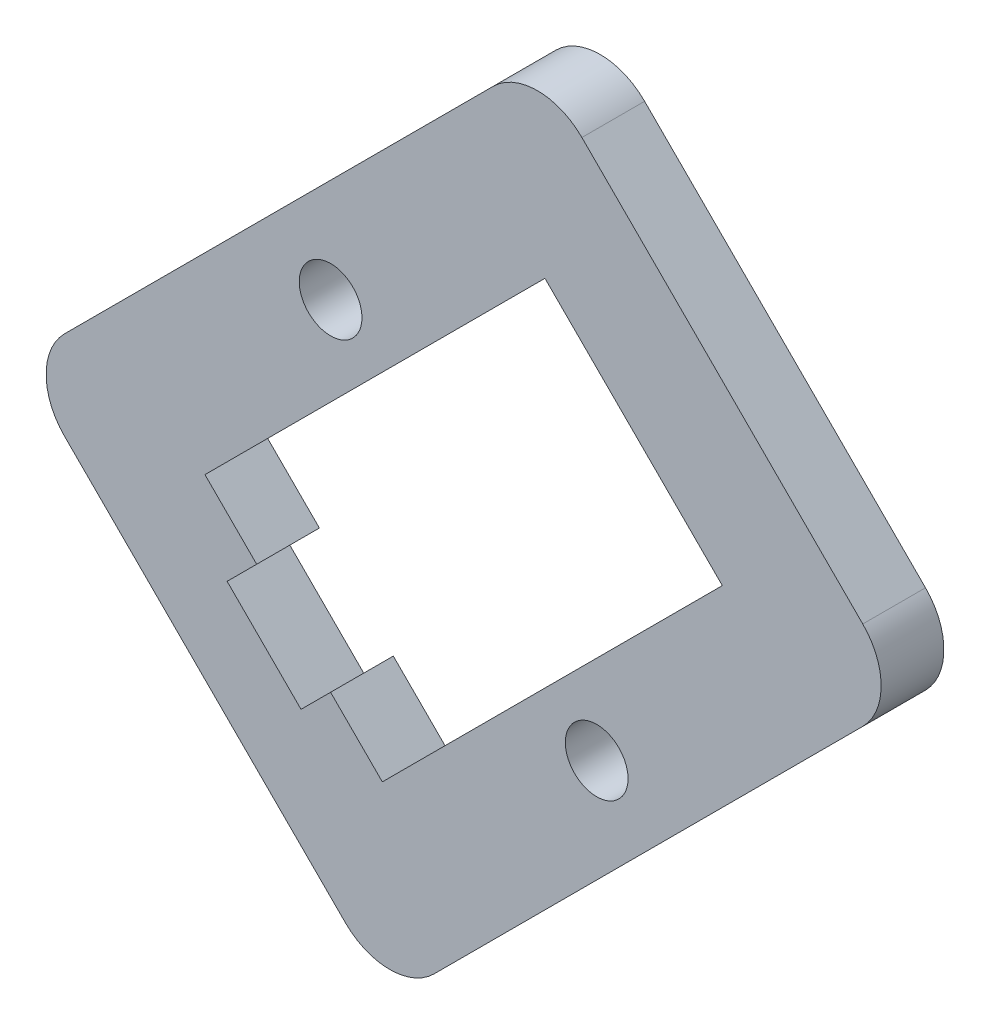
ISO-10303-21;
HEADER;
FILE_DESCRIPTION(('STEP AP214'),'2;1');
FILE_NAME('part.step','',(''),(''),'','','');
FILE_SCHEMA(('AUTOMOTIVE_DESIGN { 1 0 10303 214 1 1 1 1 }'));
ENDSEC;
DATA;
#1=APPLICATION_CONTEXT('core data for automotive mechanical design processes');
#2=APPLICATION_PROTOCOL_DEFINITION('international standard','automotive_design',2000,#1);
#3=PRODUCT_CONTEXT('',#1,'mechanical');
#4=PRODUCT('Part','Part','',(#3));
#5=PRODUCT_RELATED_PRODUCT_CATEGORY('part','',(#4));
#6=PRODUCT_DEFINITION_FORMATION('','',#4);
#7=PRODUCT_DEFINITION_CONTEXT('part definition',#1,'design');
#8=PRODUCT_DEFINITION('design','',#6,#7);
#9=PRODUCT_DEFINITION_SHAPE('','',#8);
#10=(LENGTH_UNIT() NAMED_UNIT(*) SI_UNIT(.MILLI.,.METRE.));
#11=(NAMED_UNIT(*) PLANE_ANGLE_UNIT() SI_UNIT($,.RADIAN.));
#12=(NAMED_UNIT(*) SI_UNIT($,.STERADIAN.) SOLID_ANGLE_UNIT());
#13=UNCERTAINTY_MEASURE_WITH_UNIT(LENGTH_MEASURE(1.E-05),#10,'distance_accuracy_value','');
#14=(GEOMETRIC_REPRESENTATION_CONTEXT(3) GLOBAL_UNCERTAINTY_ASSIGNED_CONTEXT((#13)) GLOBAL_UNIT_ASSIGNED_CONTEXT((#10,
#11,#12)) REPRESENTATION_CONTEXT('',''));
#15=CARTESIAN_POINT('',(0.,0.,0.));
#16=DIRECTION('',(0.,0.,1.));
#17=DIRECTION('',(1.,0.,0.));
#18=AXIS2_PLACEMENT_3D('',#15,#16,#17);
#19=CARTESIAN_POINT('',(1875.64976181669,1875.64976181676,3.));
#20=DIRECTION('',(0.707106781186536,0.707106781186559,0.));
#21=DIRECTION('',(-0.707106781186559,0.707106781186536,0.));
#22=AXIS2_PLACEMENT_3D('',#19,#20,#21);
#23=PLANE('',#22);
#24=DIRECTION('',(0.707106781186559,-0.707106781186536,0.));
#25=VECTOR('',#24,1.);
#26=CARTESIAN_POINT('',(1875.64976181669,1875.64976181676,0.));
#27=LINE('',#26,#25);
#28=CARTESIAN_POINT('',(2220.85632674039,1530.44319689307,0.));
#29=VERTEX_POINT('',#28);
#30=CARTESIAN_POINT('',(2234.29135558294,1517.00816805052,0.));
#31=VERTEX_POINT('',#30);
#32=EDGE_CURVE('E216',#29,#31,#27,.T.);
#33=ORIENTED_EDGE('',*,*,#32,.T.);
#34=DIRECTION('',(0.,0.,-1.));
#35=VECTOR('',#34,1.);
#36=CARTESIAN_POINT('',(2234.29135558294,1517.00816805052,3.));
#37=LINE('',#36,#35);
#38=CARTESIAN_POINT('',(2234.29135558294,1517.00816805052,3.));
#39=VERTEX_POINT('',#38);
#40=EDGE_CURVE('E11',#39,#31,#37,.T.);
#41=ORIENTED_EDGE('',*,*,#40,.F.);
#42=DIRECTION('',(0.707106781186559,-0.707106781186536,0.));
#43=VECTOR('',#42,1.);
#44=CARTESIAN_POINT('',(1875.64976181669,1875.64976181676,3.));
#45=LINE('',#44,#43);
#46=CARTESIAN_POINT('',(2220.85632674039,1530.44319689307,3.));
#47=VERTEX_POINT('',#46);
#48=EDGE_CURVE('E303',#47,#39,#45,.T.);
#49=ORIENTED_EDGE('',*,*,#48,.F.);
#50=DIRECTION('',(0.,0.,-1.));
#51=VECTOR('',#50,1.);
#52=CARTESIAN_POINT('',(2220.85632674039,1530.44319689307,3.));
#53=LINE('',#52,#51);
#54=EDGE_CURVE('E234',#47,#29,#53,.T.);
#55=ORIENTED_EDGE('',*,*,#54,.T.);
#56=EDGE_LOOP('',(#33,#41,#49,#55));
#57=FACE_BOUND('',#56,.T.);
#58=ADVANCED_FACE('F40',(#57),#23,.F.);
#59=CARTESIAN_POINT('',(2236.4126759265,1519.12948839408,3.));
#60=DIRECTION('',(0.,0.,-1.));
#61=DIRECTION('',(-1.,0.,0.));
#62=AXIS2_PLACEMENT_3D('',#59,#60,#61);
#63=CYLINDRICAL_SURFACE('',#62,3.00000000000019);
#64=CARTESIAN_POINT('',(2236.4126759265,1519.12948839408,0.));
#65=DIRECTION('',(0.,0.,1.));
#66=DIRECTION('',(1.,0.,0.));
#67=AXIS2_PLACEMENT_3D('',#64,#65,#66);
#68=CIRCLE('',#67,3.00000000000019);
#69=CARTESIAN_POINT('',(2238.53399627006,1517.00816805052,0.));
#70=VERTEX_POINT('',#69);
#71=EDGE_CURVE('E219',#31,#70,#68,.T.);
#72=ORIENTED_EDGE('',*,*,#71,.T.);
#73=DIRECTION('',(0.,0.,-1.));
#74=VECTOR('',#73,1.);
#75=CARTESIAN_POINT('',(2238.53399627006,1517.00816805052,3.));
#76=LINE('',#75,#74);
#77=CARTESIAN_POINT('',(2238.53399627006,1517.00816805052,3.));
#78=VERTEX_POINT('',#77);
#79=EDGE_CURVE('E50',#78,#70,#76,.T.);
#80=ORIENTED_EDGE('',*,*,#79,.F.);
#81=CARTESIAN_POINT('',(2236.4126759265,1519.12948839408,3.));
#82=DIRECTION('',(0.,0.,1.));
#83=DIRECTION('',(1.,0.,0.));
#84=AXIS2_PLACEMENT_3D('',#81,#82,#83);
#85=CIRCLE('',#84,3.00000000000019);
#86=EDGE_CURVE('E305',#39,#78,#85,.T.);
#87=ORIENTED_EDGE('',*,*,#86,.F.);
#88=ORIENTED_EDGE('',*,*,#40,.T.);
#89=EDGE_LOOP('',(#72,#80,#87,#88));
#90=FACE_BOUND('',#89,.T.);
#91=ADVANCED_FACE('F336',(#90),#63,.T.);
#92=CARTESIAN_POINT('',(360.762914109815,-360.762914109799,3.));
#93=DIRECTION('',(-0.707106781186563,0.707106781186532,0.));
#94=DIRECTION('',(-0.707106781186532,-0.707106781186563,0.));
#95=AXIS2_PLACEMENT_3D('',#92,#93,#94);
#96=PLANE('',#95);
#97=DIRECTION('',(0.707106781186532,0.707106781186563,0.));
#98=VECTOR('',#97,1.);
#99=CARTESIAN_POINT('',(360.762914109815,-360.762914109799,0.));
#100=LINE('',#99,#98);
#101=CARTESIAN_POINT('',(2259.04009292447,1537.51426470493,0.));
#102=VERTEX_POINT('',#101);
#103=EDGE_CURVE('E221',#70,#102,#100,.T.);
#104=ORIENTED_EDGE('',*,*,#103,.T.);
#105=DIRECTION('',(0.,0.,-1.));
#106=VECTOR('',#105,1.);
#107=CARTESIAN_POINT('',(2259.04009292447,1537.51426470493,3.));
#108=LINE('',#107,#106);
#109=CARTESIAN_POINT('',(2259.04009292447,1537.51426470493,3.));
#110=VERTEX_POINT('',#109);
#111=EDGE_CURVE('E240',#110,#102,#108,.T.);
#112=ORIENTED_EDGE('',*,*,#111,.F.);
#113=DIRECTION('',(0.707106781186532,0.707106781186563,0.));
#114=VECTOR('',#113,1.);
#115=CARTESIAN_POINT('',(360.762914109815,-360.762914109799,3.));
#116=LINE('',#115,#114);
#117=EDGE_CURVE('E307',#78,#110,#116,.T.);
#118=ORIENTED_EDGE('',*,*,#117,.F.);
#119=ORIENTED_EDGE('',*,*,#79,.T.);
#120=EDGE_LOOP('',(#104,#112,#118,#119));
#121=FACE_BOUND('',#120,.T.);
#122=ADVANCED_FACE('F341',(#121),#96,.F.);
#123=CARTESIAN_POINT('',(2256.91877258091,1539.63558504849,3.));
#124=DIRECTION('',(0.,0.,-1.));
#125=DIRECTION('',(-1.,0.,0.));
#126=AXIS2_PLACEMENT_3D('',#123,#124,#125);
#127=CYLINDRICAL_SURFACE('',#126,2.99999999999987);
#128=CARTESIAN_POINT('',(2256.91877258091,1539.63558504849,0.));
#129=DIRECTION('',(0.,0.,1.));
#130=DIRECTION('',(1.,0.,0.));
#131=AXIS2_PLACEMENT_3D('',#128,#129,#130);
#132=CIRCLE('',#131,2.99999999999987);
#133=CARTESIAN_POINT('',(2259.04009292447,1541.75690539205,0.));
#134=VERTEX_POINT('',#133);
#135=EDGE_CURVE('E223',#102,#134,#132,.T.);
#136=ORIENTED_EDGE('',*,*,#135,.T.);
#137=DIRECTION('',(0.,0.,-1.));
#138=VECTOR('',#137,1.);
#139=CARTESIAN_POINT('',(2259.04009292447,1541.75690539205,3.));
#140=LINE('',#139,#138);
#141=CARTESIAN_POINT('',(2259.04009292447,1541.75690539205,3.));
#142=VERTEX_POINT('',#141);
#143=EDGE_CURVE('E238',#142,#134,#140,.T.);
#144=ORIENTED_EDGE('',*,*,#143,.F.);
#145=CARTESIAN_POINT('',(2256.91877258091,1539.63558504849,3.));
#146=DIRECTION('',(0.,0.,1.));
#147=DIRECTION('',(1.,0.,0.));
#148=AXIS2_PLACEMENT_3D('',#145,#146,#147);
#149=CIRCLE('',#148,2.99999999999987);
#150=EDGE_CURVE('E309',#110,#142,#149,.T.);
#151=ORIENTED_EDGE('',*,*,#150,.F.);
#152=ORIENTED_EDGE('',*,*,#111,.T.);
#153=EDGE_LOOP('',(#136,#144,#151,#152));
#154=FACE_BOUND('',#153,.T.);
#155=ADVANCED_FACE('F382',(#154),#127,.T.);
#156=CARTESIAN_POINT('',(1900.39849915833,1900.39849915821,3.));
#157=DIRECTION('',(0.707106781186571,0.707106781186524,0.));
#158=DIRECTION('',(-0.707106781186524,0.707106781186571,0.));
#159=AXIS2_PLACEMENT_3D('',#156,#157,#158);
#160=PLANE('',#159);
#161=DIRECTION('',(0.707106781186524,-0.707106781186571,0.));
#162=VECTOR('',#161,1.);
#163=CARTESIAN_POINT('',(1900.39849915833,1900.39849915821,0.));
#164=LINE('',#163,#162);
#165=CARTESIAN_POINT('',(2245.60506408192,1555.1919342346,0.));
#166=VERTEX_POINT('',#165);
#167=EDGE_CURVE('E226',#166,#134,#164,.T.);
#168=ORIENTED_EDGE('',*,*,#167,.F.);
#169=DIRECTION('',(0.,0.,-1.));
#170=VECTOR('',#169,1.);
#171=CARTESIAN_POINT('',(2245.60506408192,1555.1919342346,3.));
#172=LINE('',#171,#170);
#173=CARTESIAN_POINT('',(2245.60506408192,1555.1919342346,3.));
#174=VERTEX_POINT('',#173);
#175=EDGE_CURVE('E178',#174,#166,#172,.T.);
#176=ORIENTED_EDGE('',*,*,#175,.F.);
#177=DIRECTION('',(0.707106781186524,-0.707106781186571,0.));
#178=VECTOR('',#177,1.);
#179=CARTESIAN_POINT('',(1900.39849915833,1900.39849915821,3.));
#180=LINE('',#179,#178);
#181=EDGE_CURVE('E167',#174,#142,#180,.T.);
#182=ORIENTED_EDGE('',*,*,#181,.T.);
#183=ORIENTED_EDGE('',*,*,#143,.T.);
#184=EDGE_LOOP('',(#168,#176,#182,#183));
#185=FACE_BOUND('',#184,.T.);
#186=ADVANCED_FACE('F312',(#185),#160,.T.);
#187=CARTESIAN_POINT('',(2243.48374373836,1553.07061389104,3.));
#188=DIRECTION('',(0.,0.,-1.));
#189=DIRECTION('',(-1.,0.,0.));
#190=AXIS2_PLACEMENT_3D('',#187,#188,#189);
#191=CYLINDRICAL_SURFACE('',#190,2.99999999999979);
#192=CARTESIAN_POINT('',(2243.48374373836,1553.07061389104,0.));
#193=DIRECTION('',(0.,0.,1.));
#194=DIRECTION('',(1.,0.,0.));
#195=AXIS2_PLACEMENT_3D('',#192,#193,#194);
#196=CIRCLE('',#195,2.99999999999979);
#197=CARTESIAN_POINT('',(2241.3624233948,1555.1919342346,0.));
#198=VERTEX_POINT('',#197);
#199=EDGE_CURVE('E174',#166,#198,#196,.T.);
#200=ORIENTED_EDGE('',*,*,#199,.T.);
#201=DIRECTION('',(0.,0.,-1.));
#202=VECTOR('',#201,1.);
#203=CARTESIAN_POINT('',(2241.3624233948,1555.1919342346,3.));
#204=LINE('',#203,#202);
#205=CARTESIAN_POINT('',(2241.3624233948,1555.1919342346,3.));
#206=VERTEX_POINT('',#205);
#207=EDGE_CURVE('E171',#206,#198,#204,.T.);
#208=ORIENTED_EDGE('',*,*,#207,.F.);
#209=CARTESIAN_POINT('',(2243.48374373836,1553.07061389104,3.));
#210=DIRECTION('',(0.,0.,1.));
#211=DIRECTION('',(1.,0.,0.));
#212=AXIS2_PLACEMENT_3D('',#209,#210,#211);
#213=CIRCLE('',#212,2.99999999999979);
#214=EDGE_CURVE('E161',#174,#206,#213,.T.);
#215=ORIENTED_EDGE('',*,*,#214,.F.);
#216=ORIENTED_EDGE('',*,*,#175,.T.);
#217=EDGE_LOOP('',(#200,#208,#215,#216));
#218=FACE_BOUND('',#217,.T.);
#219=ADVANCED_FACE('F172',(#218),#191,.T.);
#220=CARTESIAN_POINT('',(343.085244580066,-343.085244580077,3.));
#221=DIRECTION('',(-0.707106781186536,0.707106781186559,0.));
#222=DIRECTION('',(-0.707106781186559,-0.707106781186536,0.));
#223=AXIS2_PLACEMENT_3D('',#220,#221,#222);
#224=PLANE('',#223);
#225=DIRECTION('',(0.707106781186559,0.707106781186536,0.));
#226=VECTOR('',#225,1.);
#227=CARTESIAN_POINT('',(343.085244580066,-343.085244580077,0.));
#228=LINE('',#227,#226);
#229=CARTESIAN_POINT('',(2220.85632674039,1534.68583758019,0.));
#230=VERTEX_POINT('',#229);
#231=EDGE_CURVE('E230',#230,#198,#228,.T.);
#232=ORIENTED_EDGE('',*,*,#231,.F.);
#233=DIRECTION('',(0.,0.,-1.));
#234=VECTOR('',#233,1.);
#235=CARTESIAN_POINT('',(2220.85632674039,1534.68583758019,3.));
#236=LINE('',#235,#234);
#237=CARTESIAN_POINT('',(2220.85632674039,1534.68583758019,3.));
#238=VERTEX_POINT('',#237);
#239=EDGE_CURVE('E111',#238,#230,#236,.T.);
#240=ORIENTED_EDGE('',*,*,#239,.F.);
#241=DIRECTION('',(0.707106781186559,0.707106781186536,0.));
#242=VECTOR('',#241,1.);
#243=CARTESIAN_POINT('',(343.085244580066,-343.085244580077,3.));
#244=LINE('',#243,#242);
#245=EDGE_CURVE('E165',#238,#206,#244,.T.);
#246=ORIENTED_EDGE('',*,*,#245,.T.);
#247=ORIENTED_EDGE('',*,*,#207,.T.);
#248=EDGE_LOOP('',(#232,#240,#246,#247));
#249=FACE_BOUND('',#248,.T.);
#250=ADVANCED_FACE('F180',(#249),#224,.T.);
#251=CARTESIAN_POINT('',(1879.89240250325,1879.89240250426,3.));
#252=DIRECTION('',(0.707106781186357,0.707106781186738,0.));
#253=DIRECTION('',(-0.707106781186738,0.707106781186357,0.));
#254=AXIS2_PLACEMENT_3D('',#251,#252,#253);
#255=PLANE('',#254);
#256=DIRECTION('',(0.707106781186738,-0.707106781186357,0.));
#257=VECTOR('',#256,1.);
#258=CARTESIAN_POINT('',(1879.89240250325,1879.89240250426,0.));
#259=LINE('',#258,#257);
#260=CARTESIAN_POINT('',(2227.57384116166,1532.21096384604,0.));
#261=VERTEX_POINT('',#260);
#262=CARTESIAN_POINT('',(2230.04871489582,1529.73609011188,0.));
#263=VERTEX_POINT('',#262);
#264=EDGE_CURVE('E186',#261,#263,#259,.T.);
#265=ORIENTED_EDGE('',*,*,#264,.F.);
#266=DIRECTION('',(0.,0.,-1.));
#267=VECTOR('',#266,1.);
#268=CARTESIAN_POINT('',(2227.57384116166,1532.21096384604,3.));
#269=LINE('',#268,#267);
#270=CARTESIAN_POINT('',(2227.57384116166,1532.21096384604,3.));
#271=VERTEX_POINT('',#270);
#272=EDGE_CURVE('E44',#271,#261,#269,.T.);
#273=ORIENTED_EDGE('',*,*,#272,.F.);
#274=DIRECTION('',(0.707106781186738,-0.707106781186357,0.));
#275=VECTOR('',#274,1.);
#276=CARTESIAN_POINT('',(1879.89240250325,1879.89240250426,3.));
#277=LINE('',#276,#275);
#278=CARTESIAN_POINT('',(2230.04871489582,1529.73609011188,3.));
#279=VERTEX_POINT('',#278);
#280=EDGE_CURVE('E233',#271,#279,#277,.T.);
#281=ORIENTED_EDGE('',*,*,#280,.T.);
#282=DIRECTION('',(0.,0.,-1.));
#283=VECTOR('',#282,1.);
#284=CARTESIAN_POINT('',(2230.04871489582,1529.73609011188,3.));
#285=LINE('',#284,#283);
#286=EDGE_CURVE('E182',#279,#263,#285,.T.);
#287=ORIENTED_EDGE('',*,*,#286,.T.);
#288=EDGE_LOOP('',(#265,#273,#281,#287));
#289=FACE_BOUND('',#288,.T.);
#290=ADVANCED_FACE('F42',(#289),#255,.T.);
#291=CARTESIAN_POINT('',(347.681438657785,-347.681438657794,3.));
#292=DIRECTION('',(0.707106781186538,-0.707106781186557,0.));
#293=DIRECTION('',(0.707106781186557,0.707106781186538,0.));
#294=AXIS2_PLACEMENT_3D('',#291,#292,#293);
#295=PLANE('',#294);
#296=DIRECTION('',(-0.707106781186557,-0.707106781186538,0.));
#297=VECTOR('',#296,1.);
#298=CARTESIAN_POINT('',(347.681438657785,-347.681438657794,0.));
#299=LINE('',#298,#297);
#300=CARTESIAN_POINT('',(2243.83729712896,1548.47441981333,0.));
#301=VERTEX_POINT('',#300);
#302=EDGE_CURVE('E189',#301,#261,#299,.T.);
#303=ORIENTED_EDGE('',*,*,#302,.F.);
#304=DIRECTION('',(0.,0.,-1.));
#305=VECTOR('',#304,1.);
#306=CARTESIAN_POINT('',(2243.83729712896,1548.47441981333,3.));
#307=LINE('',#306,#305);
#308=CARTESIAN_POINT('',(2243.83729712896,1548.47441981333,3.));
#309=VERTEX_POINT('',#308);
#310=EDGE_CURVE('E255',#309,#301,#307,.T.);
#311=ORIENTED_EDGE('',*,*,#310,.F.);
#312=DIRECTION('',(-0.707106781186557,-0.707106781186538,0.));
#313=VECTOR('',#312,1.);
#314=CARTESIAN_POINT('',(347.681438657785,-347.681438657794,3.));
#315=LINE('',#314,#313);
#316=EDGE_CURVE('E264',#309,#271,#315,.T.);
#317=ORIENTED_EDGE('',*,*,#316,.T.);
#318=ORIENTED_EDGE('',*,*,#272,.T.);
#319=EDGE_LOOP('',(#303,#311,#317,#318));
#320=FACE_BOUND('',#319,.T.);
#321=ADVANCED_FACE('F262',(#320),#295,.T.);
#322=CARTESIAN_POINT('',(1896.15585847129,1896.15585847104,3.));
#323=DIRECTION('',(-0.707106781186594,-0.707106781186501,0.));
#324=DIRECTION('',(0.707106781186501,-0.707106781186594,0.));
#325=AXIS2_PLACEMENT_3D('',#322,#323,#324);
#326=PLANE('',#325);
#327=DIRECTION('',(-0.707106781186501,0.707106781186594,0.));
#328=VECTOR('',#327,1.);
#329=CARTESIAN_POINT('',(1896.15585847129,1896.15585847104,0.));
#330=LINE('',#329,#328);
#331=CARTESIAN_POINT('',(2252.32257850319,1539.98913843909,0.));
#332=VERTEX_POINT('',#331);
#333=EDGE_CURVE('E192',#332,#301,#330,.T.);
#334=ORIENTED_EDGE('',*,*,#333,.F.);
#335=DIRECTION('',(0.,0.,-1.));
#336=VECTOR('',#335,1.);
#337=CARTESIAN_POINT('',(2252.32257850319,1539.98913843909,3.));
#338=LINE('',#337,#336);
#339=CARTESIAN_POINT('',(2252.32257850319,1539.98913843909,3.));
#340=VERTEX_POINT('',#339);
#341=EDGE_CURVE('E254',#340,#332,#338,.T.);
#342=ORIENTED_EDGE('',*,*,#341,.F.);
#343=DIRECTION('',(-0.707106781186501,0.707106781186594,0.));
#344=VECTOR('',#343,1.);
#345=CARTESIAN_POINT('',(1896.15585847129,1896.15585847104,3.));
#346=LINE('',#345,#344);
#347=EDGE_CURVE('E272',#340,#309,#346,.T.);
#348=ORIENTED_EDGE('',*,*,#347,.T.);
#349=ORIENTED_EDGE('',*,*,#310,.T.);
#350=EDGE_LOOP('',(#334,#342,#348,#349));
#351=FACE_BOUND('',#350,.T.);
#352=ADVANCED_FACE('F270',(#351),#326,.T.);
#353=CARTESIAN_POINT('',(356.1667200321,-356.166720032085,3.));
#354=DIRECTION('',(-0.707106781186562,0.707106781186533,0.));
#355=DIRECTION('',(-0.707106781186533,-0.707106781186562,0.));
#356=AXIS2_PLACEMENT_3D('',#353,#354,#355);
#357=PLANE('',#356);
#358=DIRECTION('',(0.707106781186533,0.707106781186562,0.));
#359=VECTOR('',#358,1.);
#360=CARTESIAN_POINT('',(356.1667200321,-356.166720032085,0.));
#361=LINE('',#360,#359);
#362=CARTESIAN_POINT('',(2236.0591225359,1523.7256824718,0.));
#363=VERTEX_POINT('',#362);
#364=EDGE_CURVE('E195',#363,#332,#361,.T.);
#365=ORIENTED_EDGE('',*,*,#364,.F.);
#366=DIRECTION('',(0.,0.,-1.));
#367=VECTOR('',#366,1.);
#368=CARTESIAN_POINT('',(2236.0591225359,1523.7256824718,3.));
#369=LINE('',#368,#367);
#370=CARTESIAN_POINT('',(2236.0591225359,1523.7256824718,3.));
#371=VERTEX_POINT('',#370);
#372=EDGE_CURVE('E252',#371,#363,#369,.T.);
#373=ORIENTED_EDGE('',*,*,#372,.F.);
#374=DIRECTION('',(0.707106781186533,0.707106781186562,0.));
#375=VECTOR('',#374,1.);
#376=CARTESIAN_POINT('',(356.1667200321,-356.166720032085,3.));
#377=LINE('',#376,#375);
#378=EDGE_CURVE('E279',#371,#340,#377,.T.);
#379=ORIENTED_EDGE('',*,*,#378,.T.);
#380=ORIENTED_EDGE('',*,*,#341,.T.);
#381=EDGE_LOOP('',(#365,#373,#379,#380));
#382=FACE_BOUND('',#381,.T.);
#383=ADVANCED_FACE('F282',(#382),#357,.T.);
#384=CARTESIAN_POINT('',(1879.89240250385,1879.89240250385,3.));
#385=DIRECTION('',(0.707106781186547,0.707106781186547,0.));
#386=DIRECTION('',(-0.707106781186548,0.707106781186548,0.));
#387=AXIS2_PLACEMENT_3D('',#384,#385,#386);
#388=PLANE('',#387);
#389=DIRECTION('',(0.707106781186548,-0.707106781186548,0.));
#390=VECTOR('',#389,1.);
#391=CARTESIAN_POINT('',(1879.89240250385,1879.89240250385,0.));
#392=LINE('',#391,#390);
#393=CARTESIAN_POINT('',(2233.58424880175,1526.20055620595,0.));
#394=VERTEX_POINT('',#393);
#395=EDGE_CURVE('E198',#394,#363,#392,.T.);
#396=ORIENTED_EDGE('',*,*,#395,.F.);
#397=DIRECTION('',(0.,0.,-1.));
#398=VECTOR('',#397,1.);
#399=CARTESIAN_POINT('',(2233.58424880175,1526.20055620595,3.));
#400=LINE('',#399,#398);
#401=CARTESIAN_POINT('',(2233.58424880175,1526.20055620595,3.));
#402=VERTEX_POINT('',#401);
#403=EDGE_CURVE('E250',#402,#394,#400,.T.);
#404=ORIENTED_EDGE('',*,*,#403,.F.);
#405=DIRECTION('',(0.707106781186548,-0.707106781186548,0.));
#406=VECTOR('',#405,1.);
#407=CARTESIAN_POINT('',(1879.89240250385,1879.89240250385,3.));
#408=LINE('',#407,#406);
#409=EDGE_CURVE('E283',#402,#371,#408,.T.);
#410=ORIENTED_EDGE('',*,*,#409,.T.);
#411=ORIENTED_EDGE('',*,*,#372,.T.);
#412=EDGE_LOOP('',(#396,#404,#410,#411));
#413=FACE_BOUND('',#412,.T.);
#414=ADVANCED_FACE('F360',(#413),#388,.T.);
#415=CARTESIAN_POINT('',(353.691846297025,-353.691846297302,3.));
#416=DIRECTION('',(-0.70710678118627,0.707106781186825,0.));
#417=DIRECTION('',(-0.707106781186825,-0.70710678118627,0.));
#418=AXIS2_PLACEMENT_3D('',#415,#416,#417);
#419=PLANE('',#418);
#420=DIRECTION('',(0.707106781186825,0.70710678118627,0.));
#421=VECTOR('',#420,1.);
#422=CARTESIAN_POINT('',(353.691846297025,-353.691846297302,0.));
#423=LINE('',#422,#421);
#424=CARTESIAN_POINT('',(2232.1699645287,1524.7862719329,0.));
#425=VERTEX_POINT('',#424);
#426=EDGE_CURVE('E201',#425,#394,#423,.T.);
#427=ORIENTED_EDGE('',*,*,#426,.F.);
#428=DIRECTION('',(0.,0.,-1.));
#429=VECTOR('',#428,1.);
#430=CARTESIAN_POINT('',(2232.1699645287,1524.7862719329,3.));
#431=LINE('',#430,#429);
#432=CARTESIAN_POINT('',(2232.1699645287,1524.7862719329,3.));
#433=VERTEX_POINT('',#432);
#434=EDGE_CURVE('E248',#433,#425,#431,.T.);
#435=ORIENTED_EDGE('',*,*,#434,.F.);
#436=DIRECTION('',(0.707106781186825,0.70710678118627,0.));
#437=VECTOR('',#436,1.);
#438=CARTESIAN_POINT('',(353.691846297025,-353.691846297302,3.));
#439=LINE('',#438,#437);
#440=EDGE_CURVE('E285',#433,#402,#439,.T.);
#441=ORIENTED_EDGE('',*,*,#440,.T.);
#442=ORIENTED_EDGE('',*,*,#403,.T.);
#443=EDGE_LOOP('',(#427,#435,#441,#442));
#444=FACE_BOUND('',#443,.T.);
#445=ADVANCED_FACE('F356',(#444),#419,.T.);
#446=CARTESIAN_POINT('',(1878.47811823122,1878.47811823051,3.));
#447=DIRECTION('',(0.707106781186681,0.707106781186414,0.));
#448=DIRECTION('',(-0.707106781186414,0.707106781186681,0.));
#449=AXIS2_PLACEMENT_3D('',#446,#447,#448);
#450=PLANE('',#449);
#451=DIRECTION('',(0.707106781186414,-0.707106781186681,0.));
#452=VECTOR('',#451,1.);
#453=CARTESIAN_POINT('',(1878.47811823122,1878.47811823051,0.));
#454=LINE('',#453,#452);
#455=CARTESIAN_POINT('',(2228.63443062277,1528.32180583883,0.));
#456=VERTEX_POINT('',#455);
#457=EDGE_CURVE('E204',#456,#425,#454,.T.);
#458=ORIENTED_EDGE('',*,*,#457,.F.);
#459=DIRECTION('',(0.,0.,-1.));
#460=VECTOR('',#459,1.);
#461=CARTESIAN_POINT('',(2228.63443062277,1528.32180583883,3.));
#462=LINE('',#461,#460);
#463=CARTESIAN_POINT('',(2228.63443062277,1528.32180583883,3.));
#464=VERTEX_POINT('',#463);
#465=EDGE_CURVE('E246',#464,#456,#462,.T.);
#466=ORIENTED_EDGE('',*,*,#465,.F.);
#467=DIRECTION('',(0.707106781186414,-0.707106781186681,0.));
#468=VECTOR('',#467,1.);
#469=CARTESIAN_POINT('',(1878.47811823122,1878.47811823051,3.));
#470=LINE('',#469,#468);
#471=EDGE_CURVE('E291',#464,#433,#470,.T.);
#472=ORIENTED_EDGE('',*,*,#471,.T.);
#473=ORIENTED_EDGE('',*,*,#434,.T.);
#474=EDGE_LOOP('',(#458,#466,#472,#473));
#475=FACE_BOUND('',#474,.T.);
#476=ADVANCED_FACE('F349',(#475),#450,.T.);
#477=CARTESIAN_POINT('',(2246.31217086546,1529.73609011188,3.));
#478=DIRECTION('',(0.,0.,-1.));
#479=DIRECTION('',(-1.,0.,0.));
#480=AXIS2_PLACEMENT_3D('',#477,#478,#479);
#481=CYLINDRICAL_SURFACE('',#480,1.50000000166674);
#482=CARTESIAN_POINT('',(2246.31217086546,1529.73609011188,3.));
#483=DIRECTION('',(0.,0.,1.));
#484=DIRECTION('',(1.,0.,0.));
#485=AXIS2_PLACEMENT_3D('',#482,#483,#484);
#486=CIRCLE('',#485,1.50000000166674);
#487=CARTESIAN_POINT('',(2247.81217086713,1529.73609011188,3.));
#488=VERTEX_POINT('',#487);
#489=EDGE_CURVE('E300',#488,#488,#486,.T.);
#490=ORIENTED_EDGE('',*,*,#489,.T.);
#491=EDGE_LOOP('',(#490));
#492=FACE_BOUND('',#491,.T.);
#493=CARTESIAN_POINT('',(2246.31217086546,1529.73609011188,0.));
#494=DIRECTION('',(0.,0.,1.));
#495=DIRECTION('',(1.,0.,0.));
#496=AXIS2_PLACEMENT_3D('',#493,#494,#495);
#497=CIRCLE('',#496,1.50000000166674);
#498=CARTESIAN_POINT('',(2247.81217086713,1529.73609011188,0.));
#499=VERTEX_POINT('',#498);
#500=EDGE_CURVE('E213',#499,#499,#497,.T.);
#501=ORIENTED_EDGE('',*,*,#500,.F.);
#502=EDGE_LOOP('',(#501));
#503=FACE_BOUND('',#502,.T.);
#504=ADVANCED_FACE('F346',(#492,#503),#481,.F.);
#505=CARTESIAN_POINT('',(2233.58424880411,1542.46401217324,3.));
#506=DIRECTION('',(0.,0.,-1.));
#507=DIRECTION('',(-1.,0.,0.));
#508=AXIS2_PLACEMENT_3D('',#505,#506,#507);
#509=CYLINDRICAL_SURFACE('',#508,1.50000000166674);
#510=CARTESIAN_POINT('',(2233.58424880411,1542.46401217324,3.));
#511=DIRECTION('',(0.,0.,1.));
#512=DIRECTION('',(1.,0.,0.));
#513=AXIS2_PLACEMENT_3D('',#510,#511,#512);
#514=CIRCLE('',#513,1.50000000166674);
#515=CARTESIAN_POINT('',(2235.08424880577,1542.46401217324,3.));
#516=VERTEX_POINT('',#515);
#517=EDGE_CURVE('E297',#516,#516,#514,.T.);
#518=ORIENTED_EDGE('',*,*,#517,.T.);
#519=EDGE_LOOP('',(#518));
#520=FACE_BOUND('',#519,.T.);
#521=CARTESIAN_POINT('',(2233.58424880411,1542.46401217324,0.));
#522=DIRECTION('',(0.,0.,1.));
#523=DIRECTION('',(1.,0.,0.));
#524=AXIS2_PLACEMENT_3D('',#521,#522,#523);
#525=CIRCLE('',#524,1.50000000166674);
#526=CARTESIAN_POINT('',(2235.08424880577,1542.46401217324,0.));
#527=VERTEX_POINT('',#526);
#528=EDGE_CURVE('E210',#527,#527,#525,.T.);
#529=ORIENTED_EDGE('',*,*,#528,.F.);
#530=EDGE_LOOP('',(#529));
#531=FACE_BOUND('',#530,.T.);
#532=ADVANCED_FACE('F330',(#520,#531),#509,.F.);
#533=CARTESIAN_POINT('',(350.156312391443,-350.156312391608,3.));
#534=DIRECTION('',(0.707106781186381,-0.707106781186714,0.));
#535=DIRECTION('',(0.707106781186714,0.707106781186381,0.));
#536=AXIS2_PLACEMENT_3D('',#533,#534,#535);
#537=PLANE('',#536);
#538=DIRECTION('',(-0.707106781186714,-0.707106781186381,0.));
#539=VECTOR('',#538,1.);
#540=CARTESIAN_POINT('',(350.156312391443,-350.156312391608,0.));
#541=LINE('',#540,#539);
#542=EDGE_CURVE('E207',#263,#456,#541,.T.);
#543=ORIENTED_EDGE('',*,*,#542,.F.);
#544=ORIENTED_EDGE('',*,*,#286,.F.);
#545=DIRECTION('',(-0.707106781186714,-0.707106781186381,0.));
#546=VECTOR('',#545,1.);
#547=CARTESIAN_POINT('',(350.156312391443,-350.156312391608,3.));
#548=LINE('',#547,#546);
#549=EDGE_CURVE('E294',#279,#464,#548,.T.);
#550=ORIENTED_EDGE('',*,*,#549,.T.);
#551=ORIENTED_EDGE('',*,*,#465,.T.);
#552=EDGE_LOOP('',(#543,#544,#550,#551));
#553=FACE_BOUND('',#552,.T.);
#554=ADVANCED_FACE('F323',(#553),#537,.T.);
#555=CARTESIAN_POINT('',(2222.97764708395,1532.56451723663,3.));
#556=DIRECTION('',(0.,0.,-1.));
#557=DIRECTION('',(-1.,0.,0.));
#558=AXIS2_PLACEMENT_3D('',#555,#556,#557);
#559=CYLINDRICAL_SURFACE('',#558,3.0000000000005);
#560=CARTESIAN_POINT('',(2222.97764708395,1532.56451723663,0.));
#561=DIRECTION('',(0.,0.,1.));
#562=DIRECTION('',(1.,0.,0.));
#563=AXIS2_PLACEMENT_3D('',#560,#561,#562);
#564=CIRCLE('',#563,3.0000000000005);
#565=EDGE_CURVE('E114',#230,#29,#564,.T.);
#566=ORIENTED_EDGE('',*,*,#565,.T.);
#567=ORIENTED_EDGE('',*,*,#54,.F.);
#568=CARTESIAN_POINT('',(2222.97764708395,1532.56451723663,3.));
#569=DIRECTION('',(0.,0.,1.));
#570=DIRECTION('',(1.,0.,0.));
#571=AXIS2_PLACEMENT_3D('',#568,#569,#570);
#572=CIRCLE('',#571,3.0000000000005);
#573=EDGE_CURVE('E59',#238,#47,#572,.T.);
#574=ORIENTED_EDGE('',*,*,#573,.F.);
#575=ORIENTED_EDGE('',*,*,#239,.T.);
#576=EDGE_LOOP('',(#566,#567,#574,#575));
#577=FACE_BOUND('',#576,.T.);
#578=ADVANCED_FACE('F321',(#577),#559,.T.);
#579=CARTESIAN_POINT('',(0.,0.,3.));
#580=DIRECTION('',(0.,0.,1.));
#581=DIRECTION('',(1.,0.,0.));
#582=AXIS2_PLACEMENT_3D('',#579,#580,#581);
#583=PLANE('',#582);
#584=ORIENTED_EDGE('',*,*,#280,.F.);
#585=ORIENTED_EDGE('',*,*,#316,.F.);
#586=ORIENTED_EDGE('',*,*,#347,.F.);
#587=ORIENTED_EDGE('',*,*,#378,.F.);
#588=ORIENTED_EDGE('',*,*,#409,.F.);
#589=ORIENTED_EDGE('',*,*,#440,.F.);
#590=ORIENTED_EDGE('',*,*,#471,.F.);
#591=ORIENTED_EDGE('',*,*,#549,.F.);
#592=EDGE_LOOP('',(#584,#585,#586,#587,#588,#589,#590,#591));
#593=FACE_BOUND('',#592,.T.);
#594=ORIENTED_EDGE('',*,*,#517,.F.);
#595=EDGE_LOOP('',(#594));
#596=FACE_BOUND('',#595,.T.);
#597=ORIENTED_EDGE('',*,*,#489,.F.);
#598=EDGE_LOOP('',(#597));
#599=FACE_BOUND('',#598,.T.);
#600=ORIENTED_EDGE('',*,*,#48,.T.);
#601=ORIENTED_EDGE('',*,*,#86,.T.);
#602=ORIENTED_EDGE('',*,*,#117,.T.);
#603=ORIENTED_EDGE('',*,*,#150,.T.);
#604=ORIENTED_EDGE('',*,*,#181,.F.);
#605=ORIENTED_EDGE('',*,*,#214,.T.);
#606=ORIENTED_EDGE('',*,*,#245,.F.);
#607=ORIENTED_EDGE('',*,*,#573,.T.);
#608=EDGE_LOOP('',(#600,#601,#602,#603,#604,#605,#606,#607));
#609=FACE_BOUND('',#608,.T.);
#610=ADVANCED_FACE('F163',(#593,#596,#599,#609),#583,.T.);
#611=CARTESIAN_POINT('',(0.,0.,0.));
#612=DIRECTION('',(0.,0.,1.));
#613=DIRECTION('',(1.,0.,0.));
#614=AXIS2_PLACEMENT_3D('',#611,#612,#613);
#615=PLANE('',#614);
#616=ORIENTED_EDGE('',*,*,#264,.T.);
#617=ORIENTED_EDGE('',*,*,#542,.T.);
#618=ORIENTED_EDGE('',*,*,#457,.T.);
#619=ORIENTED_EDGE('',*,*,#426,.T.);
#620=ORIENTED_EDGE('',*,*,#395,.T.);
#621=ORIENTED_EDGE('',*,*,#364,.T.);
#622=ORIENTED_EDGE('',*,*,#333,.T.);
#623=ORIENTED_EDGE('',*,*,#302,.T.);
#624=EDGE_LOOP('',(#616,#617,#618,#619,#620,#621,#622,#623));
#625=FACE_BOUND('',#624,.T.);
#626=ORIENTED_EDGE('',*,*,#528,.T.);
#627=EDGE_LOOP('',(#626));
#628=FACE_BOUND('',#627,.T.);
#629=ORIENTED_EDGE('',*,*,#500,.T.);
#630=EDGE_LOOP('',(#629));
#631=FACE_BOUND('',#630,.T.);
#632=ORIENTED_EDGE('',*,*,#32,.F.);
#633=ORIENTED_EDGE('',*,*,#565,.F.);
#634=ORIENTED_EDGE('',*,*,#231,.T.);
#635=ORIENTED_EDGE('',*,*,#199,.F.);
#636=ORIENTED_EDGE('',*,*,#167,.T.);
#637=ORIENTED_EDGE('',*,*,#135,.F.);
#638=ORIENTED_EDGE('',*,*,#103,.F.);
#639=ORIENTED_EDGE('',*,*,#71,.F.);
#640=EDGE_LOOP('',(#632,#633,#634,#635,#636,#637,#638,#639));
#641=FACE_BOUND('',#640,.T.);
#642=ADVANCED_FACE('F267',(#625,#628,#631,#641),#615,.F.);
#643=CLOSED_SHELL('',(#58,#91,#122,#155,#186,#219,#250,#290,#321,#352,#383,#414,#445,#476,#504,
#532,#554,#578,#610,#642));
#644=MANIFOLD_SOLID_BREP('B2',#643);
#645=ADVANCED_BREP_SHAPE_REPRESENTATION('',(#18,#644),#14);
#646=SHAPE_DEFINITION_REPRESENTATION(#9,#645);
ENDSEC;
END-ISO-10303-21;
